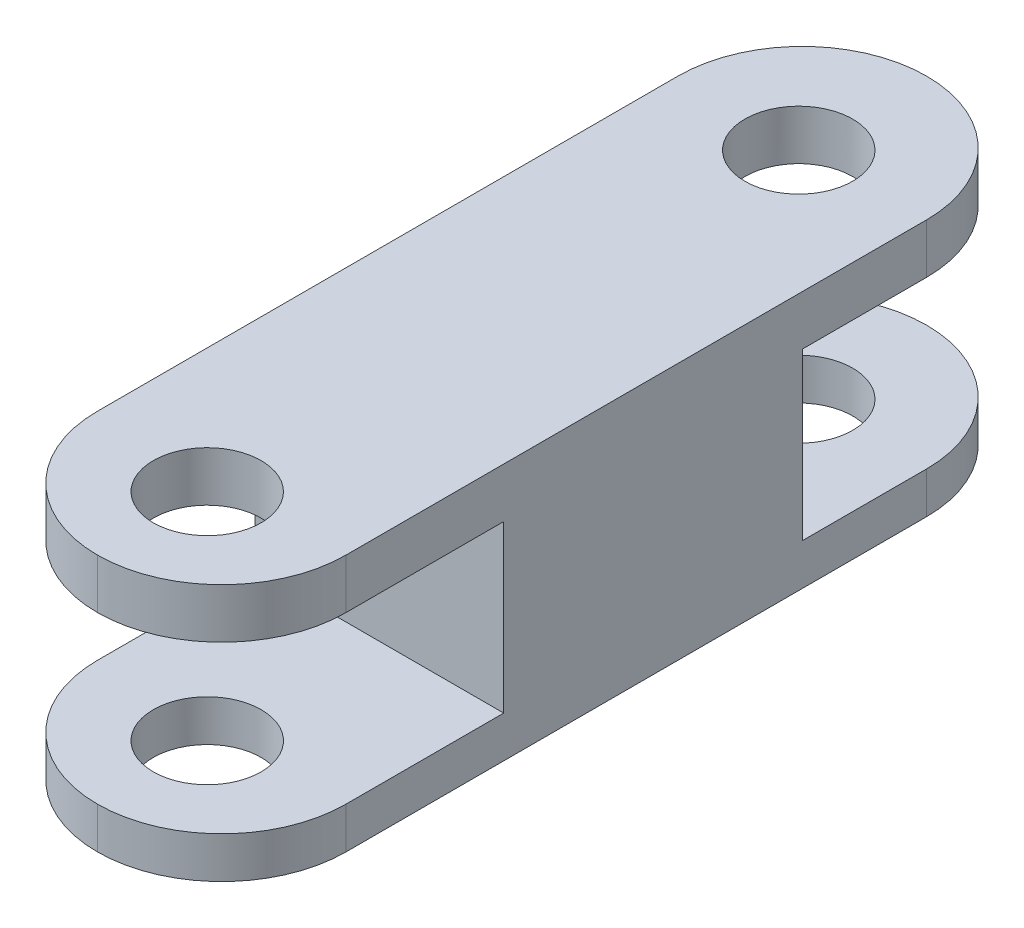
ISO-10303-21;
HEADER;
FILE_DESCRIPTION(('STEP AP214'),'2;1');
FILE_NAME('part.step','',(''),(''),'','','');
FILE_SCHEMA(('AUTOMOTIVE_DESIGN { 1 0 10303 214 1 1 1 1 }'));
ENDSEC;
DATA;
#1=APPLICATION_CONTEXT('core data for automotive mechanical design processes');
#2=APPLICATION_PROTOCOL_DEFINITION('international standard','automotive_design',2000,#1);
#3=PRODUCT_CONTEXT('',#1,'mechanical');
#4=PRODUCT('Part','Part','',(#3));
#5=PRODUCT_RELATED_PRODUCT_CATEGORY('part','',(#4));
#6=PRODUCT_DEFINITION_FORMATION('','',#4);
#7=PRODUCT_DEFINITION_CONTEXT('part definition',#1,'design');
#8=PRODUCT_DEFINITION('design','',#6,#7);
#9=PRODUCT_DEFINITION_SHAPE('','',#8);
#10=(LENGTH_UNIT() NAMED_UNIT(*) SI_UNIT(.MILLI.,.METRE.));
#11=(NAMED_UNIT(*) PLANE_ANGLE_UNIT() SI_UNIT($,.RADIAN.));
#12=(NAMED_UNIT(*) SI_UNIT($,.STERADIAN.) SOLID_ANGLE_UNIT());
#13=UNCERTAINTY_MEASURE_WITH_UNIT(LENGTH_MEASURE(1.E-05),#10,'distance_accuracy_value','');
#14=(GEOMETRIC_REPRESENTATION_CONTEXT(3) GLOBAL_UNCERTAINTY_ASSIGNED_CONTEXT((#13)) GLOBAL_UNIT_ASSIGNED_CONTEXT((#10,
#11,#12)) REPRESENTATION_CONTEXT('',''));
#15=CARTESIAN_POINT('',(0.,0.,0.));
#16=DIRECTION('',(0.,0.,1.));
#17=DIRECTION('',(1.,0.,0.));
#18=AXIS2_PLACEMENT_3D('',#15,#16,#17);
#19=CARTESIAN_POINT('',(-3.81,7.874,54.3941198587564));
#20=DIRECTION('',(0.,1.,0.));
#21=DIRECTION('',(0.,0.,1.));
#22=AXIS2_PLACEMENT_3D('',#19,#20,#21);
#23=CYLINDRICAL_SURFACE('',#22,3.81);
#24=CARTESIAN_POINT('',(-3.81,6.34827238378116,54.3941198587564));
#25=DIRECTION('',(0.,1.,0.));
#26=DIRECTION('',(0.,0.,1.));
#27=AXIS2_PLACEMENT_3D('',#24,#25,#26);
#28=CIRCLE('',#27,3.81);
#29=CARTESIAN_POINT('',(-3.81,6.34827238378116,58.2041198587564));
#30=VERTEX_POINT('',#29);
#31=CARTESIAN_POINT('',(-7.62,6.34827238378116,54.3941198587564));
#32=VERTEX_POINT('',#31);
#33=EDGE_CURVE('E245',#30,#32,#28,.F.);
#34=ORIENTED_EDGE('',*,*,#33,.F.);
#35=DIRECTION('',(0.,-1.,0.));
#36=VECTOR('',#35,1.);
#37=CARTESIAN_POINT('',(-3.81,0.,58.2041198587564));
#38=LINE('',#37,#36);
#39=CARTESIAN_POINT('',(-3.81,7.874,58.2041198587564));
#40=VERTEX_POINT('',#39);
#41=EDGE_CURVE('E188',#40,#30,#38,.T.);
#42=ORIENTED_EDGE('',*,*,#41,.F.);
#43=CARTESIAN_POINT('',(-3.81,7.874,54.3941198587564));
#44=DIRECTION('',(0.,-1.,0.));
#45=DIRECTION('',(0.,0.,-1.));
#46=AXIS2_PLACEMENT_3D('',#43,#44,#45);
#47=CIRCLE('',#46,3.81);
#48=CARTESIAN_POINT('',(-7.62,7.874,54.3941198587564));
#49=VERTEX_POINT('',#48);
#50=EDGE_CURVE('E264',#49,#40,#47,.F.);
#51=ORIENTED_EDGE('',*,*,#50,.F.);
#52=DIRECTION('',(0.,-1.,0.));
#53=VECTOR('',#52,1.);
#54=CARTESIAN_POINT('',(-7.62,7.874,54.3941198587564));
#55=LINE('',#54,#53);
#56=EDGE_CURVE('E248',#32,#49,#55,.F.);
#57=ORIENTED_EDGE('',*,*,#56,.F.);
#58=EDGE_LOOP('',(#34,#42,#51,#57));
#59=FACE_BOUND('',#58,.T.);
#60=ADVANCED_FACE('F45',(#59),#23,.T.);
#61=CARTESIAN_POINT('',(-3.81,1.26827238378116,58.2041198587564));
#62=VERTEX_POINT('',#61);
#63=CARTESIAN_POINT('',(-3.81,0.,58.2041198587564));
#64=VERTEX_POINT('',#63);
#65=EDGE_CURVE('E164',#62,#64,#38,.T.);
#66=ORIENTED_EDGE('',*,*,#65,.F.);
#67=CARTESIAN_POINT('',(-3.81,1.26827238378116,54.3941198587564));
#68=DIRECTION('',(0.,-1.,0.));
#69=DIRECTION('',(0.,0.,-1.));
#70=AXIS2_PLACEMENT_3D('',#67,#68,#69);
#71=CIRCLE('',#70,3.81);
#72=CARTESIAN_POINT('',(-7.62,1.26827238378116,54.3941198587564));
#73=VERTEX_POINT('',#72);
#74=EDGE_CURVE('E174',#73,#62,#71,.F.);
#75=ORIENTED_EDGE('',*,*,#74,.F.);
#76=CARTESIAN_POINT('',(-7.62,0.,54.3941198587564));
#77=VERTEX_POINT('',#76);
#78=EDGE_CURVE('E324',#77,#73,#55,.F.);
#79=ORIENTED_EDGE('',*,*,#78,.F.);
#80=CARTESIAN_POINT('',(-3.81,0.,54.3941198587564));
#81=DIRECTION('',(0.,-1.,0.));
#82=DIRECTION('',(0.,0.,-1.));
#83=AXIS2_PLACEMENT_3D('',#80,#81,#82);
#84=CIRCLE('',#83,3.81);
#85=EDGE_CURVE('E186',#64,#77,#84,.T.);
#86=ORIENTED_EDGE('',*,*,#85,.F.);
#87=EDGE_LOOP('',(#66,#75,#79,#86));
#88=FACE_BOUND('',#87,.T.);
#89=ADVANCED_FACE('F185',(#88),#23,.T.);
#90=CARTESIAN_POINT('',(-3.81,7.874,54.3941198587564));
#91=DIRECTION('',(0.,-1.,0.));
#92=DIRECTION('',(0.,0.,-1.));
#93=AXIS2_PLACEMENT_3D('',#90,#91,#92);
#94=CYLINDRICAL_SURFACE('',#93,3.81);
#95=ORIENTED_EDGE('',*,*,#41,.T.);
#96=CARTESIAN_POINT('',(-3.81,6.34827238378116,54.3941198587564));
#97=DIRECTION('',(0.,1.,0.));
#98=DIRECTION('',(0.,0.,1.));
#99=AXIS2_PLACEMENT_3D('',#96,#97,#98);
#100=CIRCLE('',#99,3.81);
#101=CARTESIAN_POINT('',(0.,6.34827238378116,54.3941198587564));
#102=VERTEX_POINT('',#101);
#103=EDGE_CURVE('E252',#102,#30,#100,.F.);
#104=ORIENTED_EDGE('',*,*,#103,.F.);
#105=DIRECTION('',(0.,-1.,0.));
#106=VECTOR('',#105,1.);
#107=CARTESIAN_POINT('',(0.,7.874,54.3941198587564));
#108=LINE('',#107,#106);
#109=CARTESIAN_POINT('',(0.,7.874,54.3941198587564));
#110=VERTEX_POINT('',#109);
#111=EDGE_CURVE('E261',#110,#102,#108,.T.);
#112=ORIENTED_EDGE('',*,*,#111,.F.);
#113=CARTESIAN_POINT('',(-3.81,7.874,54.3941198587564));
#114=DIRECTION('',(0.,-1.,0.));
#115=DIRECTION('',(0.,0.,-1.));
#116=AXIS2_PLACEMENT_3D('',#113,#114,#115);
#117=CIRCLE('',#116,3.81);
#118=EDGE_CURVE('E260',#40,#110,#117,.F.);
#119=ORIENTED_EDGE('',*,*,#118,.F.);
#120=EDGE_LOOP('',(#95,#104,#112,#119));
#121=FACE_BOUND('',#120,.T.);
#122=ADVANCED_FACE('F242',(#121),#94,.T.);
#123=CARTESIAN_POINT('',(-3.81,1.26827238378116,54.3941198587564));
#124=DIRECTION('',(0.,-1.,0.));
#125=DIRECTION('',(0.,0.,-1.));
#126=AXIS2_PLACEMENT_3D('',#123,#124,#125);
#127=CIRCLE('',#126,3.81);
#128=CARTESIAN_POINT('',(0.,1.26827238378116,54.3941198587564));
#129=VERTEX_POINT('',#128);
#130=EDGE_CURVE('E159',#62,#129,#127,.F.);
#131=ORIENTED_EDGE('',*,*,#130,.F.);
#132=ORIENTED_EDGE('',*,*,#65,.T.);
#133=CARTESIAN_POINT('',(-3.81,0.,54.3941198587564));
#134=DIRECTION('',(0.,-1.,0.));
#135=DIRECTION('',(0.,0.,-1.));
#136=AXIS2_PLACEMENT_3D('',#133,#134,#135);
#137=CIRCLE('',#136,3.81);
#138=CARTESIAN_POINT('',(0.,0.,54.3941198587564));
#139=VERTEX_POINT('',#138);
#140=EDGE_CURVE('E332',#139,#64,#137,.T.);
#141=ORIENTED_EDGE('',*,*,#140,.F.);
#142=EDGE_CURVE('E166',#129,#139,#108,.T.);
#143=ORIENTED_EDGE('',*,*,#142,.F.);
#144=EDGE_LOOP('',(#131,#132,#141,#143));
#145=FACE_BOUND('',#144,.T.);
#146=ADVANCED_FACE('F161',(#145),#94,.T.);
#147=CARTESIAN_POINT('',(-3.80558663679369,0.,54.8415805854161));
#148=DIRECTION('',(0.,1.,0.));
#149=DIRECTION('',(0.,0.,1.));
#150=AXIS2_PLACEMENT_3D('',#147,#148,#149);
#151=CYLINDRICAL_SURFACE('',#150,1.651);
#152=CARTESIAN_POINT('',(-3.80558663679369,7.874,54.8415805854161));
#153=DIRECTION('',(0.,1.,0.));
#154=DIRECTION('',(0.,0.,1.));
#155=AXIS2_PLACEMENT_3D('',#152,#153,#154);
#156=CIRCLE('',#155,1.651);
#157=CARTESIAN_POINT('',(-3.80558663679369,7.874,56.4925805854161));
#158=VERTEX_POINT('',#157);
#159=EDGE_CURVE('E196',#158,#158,#156,.T.);
#160=ORIENTED_EDGE('',*,*,#159,.T.);
#161=EDGE_LOOP('',(#160));
#162=FACE_BOUND('',#161,.T.);
#163=CARTESIAN_POINT('',(-3.80558663679369,6.34827238378116,54.8415805854161));
#164=DIRECTION('',(0.,1.,0.));
#165=DIRECTION('',(0.,0.,1.));
#166=AXIS2_PLACEMENT_3D('',#163,#164,#165);
#167=CIRCLE('',#166,1.651);
#168=CARTESIAN_POINT('',(-3.80558663679369,6.34827238378116,56.4925805854161));
#169=VERTEX_POINT('',#168);
#170=EDGE_CURVE('E214',#169,#169,#167,.F.);
#171=ORIENTED_EDGE('',*,*,#170,.T.);
#172=EDGE_LOOP('',(#171));
#173=FACE_BOUND('',#172,.T.);
#174=ADVANCED_FACE('F392',(#162,#173),#151,.F.);
#175=CARTESIAN_POINT('',(-3.80558663679369,0.,54.8415805854161));
#176=DIRECTION('',(0.,1.,0.));
#177=DIRECTION('',(0.,0.,1.));
#178=AXIS2_PLACEMENT_3D('',#175,#176,#177);
#179=CIRCLE('',#178,1.651);
#180=CARTESIAN_POINT('',(-3.80558663679369,0.,56.4925805854161));
#181=VERTEX_POINT('',#180);
#182=EDGE_CURVE('E189',#181,#181,#179,.T.);
#183=ORIENTED_EDGE('',*,*,#182,.F.);
#184=EDGE_LOOP('',(#183));
#185=FACE_BOUND('',#184,.T.);
#186=CARTESIAN_POINT('',(-3.80558663679369,1.26827238378116,54.8415805854161));
#187=DIRECTION('',(0.,-1.,0.));
#188=DIRECTION('',(0.,0.,-1.));
#189=AXIS2_PLACEMENT_3D('',#186,#187,#188);
#190=CIRCLE('',#189,1.651);
#191=CARTESIAN_POINT('',(-3.80558663679369,1.26827238378116,53.1905805854161));
#192=VERTEX_POINT('',#191);
#193=EDGE_CURVE('E53',#192,#192,#190,.F.);
#194=ORIENTED_EDGE('',*,*,#193,.T.);
#195=EDGE_LOOP('',(#194));
#196=FACE_BOUND('',#195,.T.);
#197=ADVANCED_FACE('F221',(#185,#196),#151,.F.);
#198=CARTESIAN_POINT('',(-3.80558663679368,0.,36.7263005854161));
#199=DIRECTION('',(0.,1.,0.));
#200=DIRECTION('',(0.,0.,1.));
#201=AXIS2_PLACEMENT_3D('',#198,#199,#200);
#202=CYLINDRICAL_SURFACE('',#201,1.651);
#203=CARTESIAN_POINT('',(-3.80558663679368,0.,36.7263005854161));
#204=DIRECTION('',(0.,1.,0.));
#205=DIRECTION('',(0.,0.,1.));
#206=AXIS2_PLACEMENT_3D('',#203,#204,#205);
#207=CIRCLE('',#206,1.651);
#208=CARTESIAN_POINT('',(-3.80558663679368,0.,38.3773005854161));
#209=VERTEX_POINT('',#208);
#210=EDGE_CURVE('E374',#209,#209,#207,.T.);
#211=ORIENTED_EDGE('',*,*,#210,.F.);
#212=EDGE_LOOP('',(#211));
#213=FACE_BOUND('',#212,.T.);
#214=CARTESIAN_POINT('',(-3.80558663679368,1.26827238378116,36.7263005854161));
#215=DIRECTION('',(0.,1.,0.));
#216=DIRECTION('',(0.,0.,1.));
#217=AXIS2_PLACEMENT_3D('',#214,#215,#216);
#218=CIRCLE('',#217,1.651);
#219=CARTESIAN_POINT('',(-3.80558663679368,1.26827238378116,38.3773005854161));
#220=VERTEX_POINT('',#219);
#221=EDGE_CURVE('E202',#220,#220,#218,.F.);
#222=ORIENTED_EDGE('',*,*,#221,.F.);
#223=EDGE_LOOP('',(#222));
#224=FACE_BOUND('',#223,.T.);
#225=ADVANCED_FACE('F400',(#213,#224),#202,.F.);
#226=CARTESIAN_POINT('',(-3.80999999999999,7.874,36.6141198587564));
#227=DIRECTION('',(0.,-1.,0.));
#228=DIRECTION('',(0.,0.,-1.));
#229=AXIS2_PLACEMENT_3D('',#226,#227,#228);
#230=CYLINDRICAL_SURFACE('',#229,3.81);
#231=CARTESIAN_POINT('',(-3.80999999999999,1.26827238378116,36.6141198587564));
#232=DIRECTION('',(0.,-1.,0.));
#233=DIRECTION('',(0.,0.,-1.));
#234=AXIS2_PLACEMENT_3D('',#231,#232,#233);
#235=CIRCLE('',#234,3.81);
#236=CARTESIAN_POINT('',(0.,1.26827238378116,36.6141198587564));
#237=VERTEX_POINT('',#236);
#238=CARTESIAN_POINT('',(-3.80999999999999,1.26827238378116,32.8041198587565));
#239=VERTEX_POINT('',#238);
#240=EDGE_CURVE('E349',#237,#239,#235,.F.);
#241=ORIENTED_EDGE('',*,*,#240,.F.);
#242=DIRECTION('',(0.,-1.,0.));
#243=VECTOR('',#242,1.);
#244=CARTESIAN_POINT('',(0.,7.874,36.6141198587564));
#245=LINE('',#244,#243);
#246=CARTESIAN_POINT('',(0.,0.,36.6141198587564));
#247=VERTEX_POINT('',#246);
#248=EDGE_CURVE('E207',#247,#237,#245,.F.);
#249=ORIENTED_EDGE('',*,*,#248,.F.);
#250=CARTESIAN_POINT('',(-3.80999999999999,0.,36.6141198587564));
#251=DIRECTION('',(0.,-1.,0.));
#252=DIRECTION('',(0.,0.,-1.));
#253=AXIS2_PLACEMENT_3D('',#250,#251,#252);
#254=CIRCLE('',#253,3.81);
#255=CARTESIAN_POINT('',(-3.80999999999999,0.,32.8041198587565));
#256=VERTEX_POINT('',#255);
#257=EDGE_CURVE('E335',#256,#247,#254,.T.);
#258=ORIENTED_EDGE('',*,*,#257,.F.);
#259=DIRECTION('',(0.,-1.,0.));
#260=VECTOR('',#259,1.);
#261=CARTESIAN_POINT('',(-3.80999999999999,7.874,32.8041198587565));
#262=LINE('',#261,#260);
#263=EDGE_CURVE('E194',#239,#256,#262,.T.);
#264=ORIENTED_EDGE('',*,*,#263,.F.);
#265=EDGE_LOOP('',(#241,#249,#258,#264));
#266=FACE_BOUND('',#265,.T.);
#267=ADVANCED_FACE('F348',(#266),#230,.T.);
#268=CARTESIAN_POINT('',(-3.80999999999999,7.874,36.6141198587564));
#269=DIRECTION('',(0.,1.,0.));
#270=DIRECTION('',(0.,0.,1.));
#271=AXIS2_PLACEMENT_3D('',#268,#269,#270);
#272=CYLINDRICAL_SURFACE('',#271,3.81);
#273=CARTESIAN_POINT('',(-3.80999999999999,1.26827238378116,36.6141198587564));
#274=DIRECTION('',(0.,-1.,0.));
#275=DIRECTION('',(0.,0.,-1.));
#276=AXIS2_PLACEMENT_3D('',#273,#274,#275);
#277=CIRCLE('',#276,3.81);
#278=CARTESIAN_POINT('',(-7.62,1.26827238378116,36.6141198587564));
#279=VERTEX_POINT('',#278);
#280=EDGE_CURVE('E355',#239,#279,#277,.F.);
#281=ORIENTED_EDGE('',*,*,#280,.F.);
#282=ORIENTED_EDGE('',*,*,#263,.T.);
#283=CARTESIAN_POINT('',(-3.80999999999999,0.,36.6141198587564));
#284=DIRECTION('',(0.,-1.,0.));
#285=DIRECTION('',(0.,0.,-1.));
#286=AXIS2_PLACEMENT_3D('',#283,#284,#285);
#287=CIRCLE('',#286,3.81);
#288=CARTESIAN_POINT('',(-7.61999999999999,0.,36.6141198587564));
#289=VERTEX_POINT('',#288);
#290=EDGE_CURVE('E270',#289,#256,#287,.T.);
#291=ORIENTED_EDGE('',*,*,#290,.F.);
#292=DIRECTION('',(0.,-1.,0.));
#293=VECTOR('',#292,1.);
#294=CARTESIAN_POINT('',(-7.61999999999999,0.,36.6141198587564));
#295=LINE('',#294,#293);
#296=EDGE_CURVE('E327',#279,#289,#295,.T.);
#297=ORIENTED_EDGE('',*,*,#296,.F.);
#298=EDGE_LOOP('',(#281,#282,#291,#297));
#299=FACE_BOUND('',#298,.T.);
#300=ADVANCED_FACE('F412',(#299),#272,.T.);
#301=CARTESIAN_POINT('',(-7.61999999999999,7.874,32.8041198587565));
#302=DIRECTION('',(1.,0.,0.));
#303=DIRECTION('',(0.,0.,-1.));
#304=AXIS2_PLACEMENT_3D('',#301,#302,#303);
#305=PLANE('',#304);
#306=ORIENTED_EDGE('',*,*,#78,.T.);
#307=DIRECTION('',(0.,0.,-1.));
#308=VECTOR('',#307,1.);
#309=CARTESIAN_POINT('',(-7.61999999999999,1.26827238378116,32.8041198587565));
#310=LINE('',#309,#308);
#311=CARTESIAN_POINT('',(-7.61999999999999,1.26827238378116,49.5681198587564));
#312=VERTEX_POINT('',#311);
#313=EDGE_CURVE('E178',#73,#312,#310,.T.);
#314=ORIENTED_EDGE('',*,*,#313,.T.);
#315=DIRECTION('',(0.,1.,0.));
#316=VECTOR('',#315,1.);
#317=CARTESIAN_POINT('',(-7.61999999999999,7.874,49.5681198587564));
#318=LINE('',#317,#316);
#319=CARTESIAN_POINT('',(-7.61999999999999,6.34827238378116,49.5681198587564));
#320=VERTEX_POINT('',#319);
#321=EDGE_CURVE('E561',#312,#320,#318,.T.);
#322=ORIENTED_EDGE('',*,*,#321,.T.);
#323=DIRECTION('',(0.,0.,1.));
#324=VECTOR('',#323,1.);
#325=CARTESIAN_POINT('',(-7.61999999999999,6.34827238378116,32.8041198587565));
#326=LINE('',#325,#324);
#327=EDGE_CURVE('E171',#320,#32,#326,.T.);
#328=ORIENTED_EDGE('',*,*,#327,.T.);
#329=ORIENTED_EDGE('',*,*,#56,.T.);
#330=DIRECTION('',(0.,0.,1.));
#331=VECTOR('',#330,1.);
#332=CARTESIAN_POINT('',(-7.61999999999999,7.874,32.8041198587565));
#333=LINE('',#332,#331);
#334=CARTESIAN_POINT('',(-7.61999999999999,7.874,36.6141198587564));
#335=VERTEX_POINT('',#334);
#336=EDGE_CURVE('E295',#335,#49,#333,.T.);
#337=ORIENTED_EDGE('',*,*,#336,.F.);
#338=CARTESIAN_POINT('',(-7.62,6.34827238378116,36.6141198587564));
#339=VERTEX_POINT('',#338);
#340=EDGE_CURVE('E307',#335,#339,#295,.T.);
#341=ORIENTED_EDGE('',*,*,#340,.T.);
#342=DIRECTION('',(0.,0.,-1.));
#343=VECTOR('',#342,1.);
#344=CARTESIAN_POINT('',(-7.62,6.34827238378116,40.4241198587564));
#345=LINE('',#344,#343);
#346=CARTESIAN_POINT('',(-7.62,6.34827238378116,40.4241198587564));
#347=VERTEX_POINT('',#346);
#348=EDGE_CURVE('E571',#347,#339,#345,.T.);
#349=ORIENTED_EDGE('',*,*,#348,.F.);
#350=DIRECTION('',(0.,1.,0.));
#351=VECTOR('',#350,1.);
#352=CARTESIAN_POINT('',(-7.62,6.34827238378116,40.4241198587564));
#353=LINE('',#352,#351);
#354=CARTESIAN_POINT('',(-7.62,1.26827238378116,40.4241198587564));
#355=VERTEX_POINT('',#354);
#356=EDGE_CURVE('E354',#347,#355,#353,.F.);
#357=ORIENTED_EDGE('',*,*,#356,.T.);
#358=DIRECTION('',(0.,0.,1.));
#359=VECTOR('',#358,1.);
#360=CARTESIAN_POINT('',(-7.62,1.26827238378116,36.6141198587564));
#361=LINE('',#360,#359);
#362=EDGE_CURVE('E568',#279,#355,#361,.T.);
#363=ORIENTED_EDGE('',*,*,#362,.F.);
#364=ORIENTED_EDGE('',*,*,#296,.T.);
#365=DIRECTION('',(0.,0.,1.));
#366=VECTOR('',#365,1.);
#367=CARTESIAN_POINT('',(-7.61999999999999,0.,32.8041198587565));
#368=LINE('',#367,#366);
#369=EDGE_CURVE('E303',#289,#77,#368,.T.);
#370=ORIENTED_EDGE('',*,*,#369,.T.);
#371=EDGE_LOOP('',(#306,#314,#322,#328,#329,#337,#341,#349,#357,#363,#364,#370));
#372=FACE_BOUND('',#371,.T.);
#373=ADVANCED_FACE('F311',(#372),#305,.F.);
#374=CARTESIAN_POINT('',(0.,7.874,32.8041198587565));
#375=DIRECTION('',(1.,0.,0.));
#376=DIRECTION('',(0.,0.,-1.));
#377=AXIS2_PLACEMENT_3D('',#374,#375,#376);
#378=PLANE('',#377);
#379=DIRECTION('',(0.,0.,-1.));
#380=VECTOR('',#379,1.);
#381=CARTESIAN_POINT('',(0.,1.26827238378116,32.8041198587565));
#382=LINE('',#381,#380);
#383=CARTESIAN_POINT('',(0.,1.26827238378116,49.5681198587564));
#384=VERTEX_POINT('',#383);
#385=EDGE_CURVE('E170',#129,#384,#382,.T.);
#386=ORIENTED_EDGE('',*,*,#385,.F.);
#387=ORIENTED_EDGE('',*,*,#142,.T.);
#388=DIRECTION('',(0.,0.,1.));
#389=VECTOR('',#388,1.);
#390=CARTESIAN_POINT('',(0.,0.,32.8041198587565));
#391=LINE('',#390,#389);
#392=EDGE_CURVE('E314',#247,#139,#391,.T.);
#393=ORIENTED_EDGE('',*,*,#392,.F.);
#394=ORIENTED_EDGE('',*,*,#248,.T.);
#395=DIRECTION('',(0.,0.,1.));
#396=VECTOR('',#395,1.);
#397=CARTESIAN_POINT('',(0.,1.26827238378116,32.8041198587565));
#398=LINE('',#397,#396);
#399=CARTESIAN_POINT('',(0.,1.26827238378116,40.4241198587564));
#400=VERTEX_POINT('',#399);
#401=EDGE_CURVE('E358',#237,#400,#398,.T.);
#402=ORIENTED_EDGE('',*,*,#401,.T.);
#403=DIRECTION('',(0.,-1.,0.));
#404=VECTOR('',#403,1.);
#405=CARTESIAN_POINT('',(0.,7.874,40.4241198587564));
#406=LINE('',#405,#404);
#407=CARTESIAN_POINT('',(0.,6.34827238378116,40.4241198587564));
#408=VERTEX_POINT('',#407);
#409=EDGE_CURVE('E211',#408,#400,#406,.T.);
#410=ORIENTED_EDGE('',*,*,#409,.F.);
#411=DIRECTION('',(0.,0.,-1.));
#412=VECTOR('',#411,1.);
#413=CARTESIAN_POINT('',(0.,6.34827238378116,32.8041198587565));
#414=LINE('',#413,#412);
#415=CARTESIAN_POINT('',(0.,6.34827238378116,36.6141198587564));
#416=VERTEX_POINT('',#415);
#417=EDGE_CURVE('E290',#408,#416,#414,.T.);
#418=ORIENTED_EDGE('',*,*,#417,.T.);
#419=CARTESIAN_POINT('',(0.,7.874,36.6141198587564));
#420=VERTEX_POINT('',#419);
#421=EDGE_CURVE('E277',#416,#420,#245,.F.);
#422=ORIENTED_EDGE('',*,*,#421,.T.);
#423=DIRECTION('',(0.,0.,1.));
#424=VECTOR('',#423,1.);
#425=CARTESIAN_POINT('',(0.,7.874,32.8041198587565));
#426=LINE('',#425,#424);
#427=EDGE_CURVE('E288',#420,#110,#426,.T.);
#428=ORIENTED_EDGE('',*,*,#427,.T.);
#429=ORIENTED_EDGE('',*,*,#111,.T.);
#430=DIRECTION('',(0.,0.,1.));
#431=VECTOR('',#430,1.);
#432=CARTESIAN_POINT('',(0.,6.34827238378116,32.8041198587565));
#433=LINE('',#432,#431);
#434=CARTESIAN_POINT('',(0.,6.34827238378116,49.5681198587564));
#435=VERTEX_POINT('',#434);
#436=EDGE_CURVE('E60',#435,#102,#433,.T.);
#437=ORIENTED_EDGE('',*,*,#436,.F.);
#438=DIRECTION('',(0.,1.,0.));
#439=VECTOR('',#438,1.);
#440=CARTESIAN_POINT('',(0.,7.874,49.5681198587564));
#441=LINE('',#440,#439);
#442=EDGE_CURVE('E11',#384,#435,#441,.T.);
#443=ORIENTED_EDGE('',*,*,#442,.F.);
#444=EDGE_LOOP('',(#386,#387,#393,#394,#402,#410,#418,#422,#428,#429,#437,#443));
#445=FACE_BOUND('',#444,.T.);
#446=ADVANCED_FACE('F287',(#445),#378,.T.);
#447=CARTESIAN_POINT('',(-3.80558663679368,7.874,36.7263005854161));
#448=DIRECTION('',(0.,1.,0.));
#449=DIRECTION('',(0.,0.,1.));
#450=AXIS2_PLACEMENT_3D('',#447,#448,#449);
#451=CIRCLE('',#450,1.651);
#452=CARTESIAN_POINT('',(-3.80558663679368,7.874,38.3773005854161));
#453=VERTEX_POINT('',#452);
#454=EDGE_CURVE('E368',#453,#453,#451,.T.);
#455=ORIENTED_EDGE('',*,*,#454,.T.);
#456=EDGE_LOOP('',(#455));
#457=FACE_BOUND('',#456,.T.);
#458=CARTESIAN_POINT('',(-3.80558663679368,6.34827238378116,36.7263005854161));
#459=DIRECTION('',(0.,-1.,0.));
#460=DIRECTION('',(0.,0.,-1.));
#461=AXIS2_PLACEMENT_3D('',#458,#459,#460);
#462=CIRCLE('',#461,1.651);
#463=CARTESIAN_POINT('',(-3.80558663679368,6.34827238378116,35.0753005854161));
#464=VERTEX_POINT('',#463);
#465=EDGE_CURVE('E206',#464,#464,#462,.F.);
#466=ORIENTED_EDGE('',*,*,#465,.F.);
#467=EDGE_LOOP('',(#466));
#468=FACE_BOUND('',#467,.T.);
#469=ADVANCED_FACE('F382',(#457,#468),#202,.F.);
#470=CARTESIAN_POINT('',(0.,7.874,0.));
#471=DIRECTION('',(0.,-1.,0.));
#472=DIRECTION('',(-1.,0.,0.));
#473=AXIS2_PLACEMENT_3D('',#470,#471,#472);
#474=PLANE('',#473);
#475=ORIENTED_EDGE('',*,*,#454,.F.);
#476=EDGE_LOOP('',(#475));
#477=FACE_BOUND('',#476,.T.);
#478=ORIENTED_EDGE('',*,*,#159,.F.);
#479=EDGE_LOOP('',(#478));
#480=FACE_BOUND('',#479,.T.);
#481=CARTESIAN_POINT('',(-3.80999999999999,7.874,36.6141198587564));
#482=DIRECTION('',(0.,-1.,0.));
#483=DIRECTION('',(0.,0.,-1.));
#484=AXIS2_PLACEMENT_3D('',#481,#482,#483);
#485=CIRCLE('',#484,3.81);
#486=CARTESIAN_POINT('',(-3.80999999999999,7.874,32.8041198587565));
#487=VERTEX_POINT('',#486);
#488=EDGE_CURVE('E68',#420,#487,#485,.F.);
#489=ORIENTED_EDGE('',*,*,#488,.T.);
#490=CARTESIAN_POINT('',(-3.80999999999999,7.874,36.6141198587564));
#491=DIRECTION('',(0.,-1.,0.));
#492=DIRECTION('',(0.,0.,-1.));
#493=AXIS2_PLACEMENT_3D('',#490,#491,#492);
#494=CIRCLE('',#493,3.81);
#495=EDGE_CURVE('E268',#487,#335,#494,.F.);
#496=ORIENTED_EDGE('',*,*,#495,.T.);
#497=ORIENTED_EDGE('',*,*,#336,.T.);
#498=ORIENTED_EDGE('',*,*,#50,.T.);
#499=ORIENTED_EDGE('',*,*,#118,.T.);
#500=ORIENTED_EDGE('',*,*,#427,.F.);
#501=EDGE_LOOP('',(#489,#496,#497,#498,#499,#500));
#502=FACE_BOUND('',#501,.T.);
#503=ADVANCED_FACE('F293',(#477,#480,#502),#474,.F.);
#504=CARTESIAN_POINT('',(0.,0.,0.));
#505=DIRECTION('',(0.,-1.,0.));
#506=DIRECTION('',(-1.,0.,0.));
#507=AXIS2_PLACEMENT_3D('',#504,#505,#506);
#508=PLANE('',#507);
#509=ORIENTED_EDGE('',*,*,#210,.T.);
#510=EDGE_LOOP('',(#509));
#511=FACE_BOUND('',#510,.T.);
#512=ORIENTED_EDGE('',*,*,#182,.T.);
#513=EDGE_LOOP('',(#512));
#514=FACE_BOUND('',#513,.T.);
#515=ORIENTED_EDGE('',*,*,#369,.F.);
#516=ORIENTED_EDGE('',*,*,#290,.T.);
#517=ORIENTED_EDGE('',*,*,#257,.T.);
#518=ORIENTED_EDGE('',*,*,#392,.T.);
#519=ORIENTED_EDGE('',*,*,#140,.T.);
#520=ORIENTED_EDGE('',*,*,#85,.T.);
#521=EDGE_LOOP('',(#515,#516,#517,#518,#519,#520));
#522=FACE_BOUND('',#521,.T.);
#523=ADVANCED_FACE('F343',(#511,#514,#522),#508,.T.);
#524=CARTESIAN_POINT('',(-3.80999999999999,6.34827238378116,36.6141198587564));
#525=DIRECTION('',(0.,1.,0.));
#526=DIRECTION('',(0.,0.,1.));
#527=AXIS2_PLACEMENT_3D('',#524,#525,#526);
#528=CIRCLE('',#527,3.81);
#529=CARTESIAN_POINT('',(-3.80999999999999,6.34827238378116,32.8041198587565));
#530=VERTEX_POINT('',#529);
#531=EDGE_CURVE('E300',#530,#416,#528,.F.);
#532=ORIENTED_EDGE('',*,*,#531,.F.);
#533=EDGE_CURVE('E200',#487,#530,#262,.T.);
#534=ORIENTED_EDGE('',*,*,#533,.F.);
#535=ORIENTED_EDGE('',*,*,#488,.F.);
#536=ORIENTED_EDGE('',*,*,#421,.F.);
#537=EDGE_LOOP('',(#532,#534,#535,#536));
#538=FACE_BOUND('',#537,.T.);
#539=ADVANCED_FACE('F297',(#538),#230,.T.);
#540=CARTESIAN_POINT('',(-3.80999999999999,6.34827238378116,36.6141198587564));
#541=DIRECTION('',(0.,1.,0.));
#542=DIRECTION('',(0.,0.,1.));
#543=AXIS2_PLACEMENT_3D('',#540,#541,#542);
#544=CIRCLE('',#543,3.81);
#545=EDGE_CURVE('E555',#339,#530,#544,.F.);
#546=ORIENTED_EDGE('',*,*,#545,.F.);
#547=ORIENTED_EDGE('',*,*,#340,.F.);
#548=ORIENTED_EDGE('',*,*,#495,.F.);
#549=ORIENTED_EDGE('',*,*,#533,.T.);
#550=EDGE_LOOP('',(#546,#547,#548,#549));
#551=FACE_BOUND('',#550,.T.);
#552=ADVANCED_FACE('F305',(#551),#272,.T.);
#553=CARTESIAN_POINT('',(-7.62,6.34827238378116,40.4241198587564));
#554=DIRECTION('',(0.,-1.,0.));
#555=DIRECTION('',(0.,0.,-1.));
#556=AXIS2_PLACEMENT_3D('',#553,#554,#555);
#557=PLANE('',#556);
#558=ORIENTED_EDGE('',*,*,#531,.T.);
#559=ORIENTED_EDGE('',*,*,#417,.F.);
#560=DIRECTION('',(1.,0.,0.));
#561=VECTOR('',#560,1.);
#562=CARTESIAN_POINT('',(-7.62,6.34827238378116,40.4241198587564));
#563=LINE('',#562,#561);
#564=EDGE_CURVE('E364',#347,#408,#563,.T.);
#565=ORIENTED_EDGE('',*,*,#564,.F.);
#566=ORIENTED_EDGE('',*,*,#348,.T.);
#567=ORIENTED_EDGE('',*,*,#545,.T.);
#568=EDGE_LOOP('',(#558,#559,#565,#566,#567));
#569=FACE_BOUND('',#568,.T.);
#570=ORIENTED_EDGE('',*,*,#465,.T.);
#571=EDGE_LOOP('',(#570));
#572=FACE_BOUND('',#571,.T.);
#573=ADVANCED_FACE('F415',(#569,#572),#557,.T.);
#574=CARTESIAN_POINT('',(-7.62,1.26827238378116,36.6141198587564));
#575=DIRECTION('',(0.,1.,0.));
#576=DIRECTION('',(0.,0.,1.));
#577=AXIS2_PLACEMENT_3D('',#574,#575,#576);
#578=PLANE('',#577);
#579=ORIENTED_EDGE('',*,*,#401,.F.);
#580=ORIENTED_EDGE('',*,*,#240,.T.);
#581=ORIENTED_EDGE('',*,*,#280,.T.);
#582=ORIENTED_EDGE('',*,*,#362,.T.);
#583=DIRECTION('',(1.,0.,0.));
#584=VECTOR('',#583,1.);
#585=CARTESIAN_POINT('',(-7.62,1.26827238378116,40.4241198587564));
#586=LINE('',#585,#584);
#587=EDGE_CURVE('E362',#355,#400,#586,.T.);
#588=ORIENTED_EDGE('',*,*,#587,.T.);
#589=EDGE_LOOP('',(#579,#580,#581,#582,#588));
#590=FACE_BOUND('',#589,.T.);
#591=ORIENTED_EDGE('',*,*,#221,.T.);
#592=EDGE_LOOP('',(#591));
#593=FACE_BOUND('',#592,.T.);
#594=ADVANCED_FACE('F359',(#590,#593),#578,.T.);
#595=CARTESIAN_POINT('',(-7.62,6.34827238378116,40.4241198587564));
#596=DIRECTION('',(0.,0.,1.));
#597=DIRECTION('',(1.,0.,0.));
#598=AXIS2_PLACEMENT_3D('',#595,#596,#597);
#599=PLANE('',#598);
#600=ORIENTED_EDGE('',*,*,#409,.T.);
#601=ORIENTED_EDGE('',*,*,#587,.F.);
#602=ORIENTED_EDGE('',*,*,#356,.F.);
#603=ORIENTED_EDGE('',*,*,#564,.T.);
#604=EDGE_LOOP('',(#600,#601,#602,#603));
#605=FACE_BOUND('',#604,.T.);
#606=ADVANCED_FACE('F233',(#605),#599,.F.);
#607=CARTESIAN_POINT('',(1.19999999821559E-05,6.34827238378116,49.5681198587564));
#608=DIRECTION('',(0.,0.,-1.));
#609=DIRECTION('',(-1.,0.,0.));
#610=AXIS2_PLACEMENT_3D('',#607,#608,#609);
#611=PLANE('',#610);
#612=DIRECTION('',(-1.,0.,0.));
#613=VECTOR('',#612,1.);
#614=CARTESIAN_POINT('',(1.19999999821559E-05,1.26827238378116,49.5681198587564));
#615=LINE('',#614,#613);
#616=EDGE_CURVE('E258',#384,#312,#615,.T.);
#617=ORIENTED_EDGE('',*,*,#616,.F.);
#618=ORIENTED_EDGE('',*,*,#442,.T.);
#619=DIRECTION('',(-1.,0.,0.));
#620=VECTOR('',#619,1.);
#621=CARTESIAN_POINT('',(1.19999999821559E-05,6.34827238378116,49.5681198587564));
#622=LINE('',#621,#620);
#623=EDGE_CURVE('E592',#435,#320,#622,.T.);
#624=ORIENTED_EDGE('',*,*,#623,.T.);
#625=ORIENTED_EDGE('',*,*,#321,.F.);
#626=EDGE_LOOP('',(#617,#618,#624,#625));
#627=FACE_BOUND('',#626,.T.);
#628=ADVANCED_FACE('F225',(#627),#611,.F.);
#629=CARTESIAN_POINT('',(1.19999999821559E-05,1.26827238378116,49.5681198587564));
#630=DIRECTION('',(0.,-1.,0.));
#631=DIRECTION('',(0.,0.,-1.));
#632=AXIS2_PLACEMENT_3D('',#629,#630,#631);
#633=PLANE('',#632);
#634=ORIENTED_EDGE('',*,*,#193,.F.);
#635=EDGE_LOOP('',(#634));
#636=FACE_BOUND('',#635,.T.);
#637=ORIENTED_EDGE('',*,*,#74,.T.);
#638=ORIENTED_EDGE('',*,*,#130,.T.);
#639=ORIENTED_EDGE('',*,*,#385,.T.);
#640=ORIENTED_EDGE('',*,*,#616,.T.);
#641=ORIENTED_EDGE('',*,*,#313,.F.);
#642=EDGE_LOOP('',(#637,#638,#639,#640,#641));
#643=FACE_BOUND('',#642,.T.);
#644=ADVANCED_FACE('F175',(#636,#643),#633,.F.);
#645=CARTESIAN_POINT('',(1.19999999802733E-05,6.34827238378116,54.6481198587565));
#646=DIRECTION('',(0.,1.,0.));
#647=DIRECTION('',(0.,0.,1.));
#648=AXIS2_PLACEMENT_3D('',#645,#646,#647);
#649=PLANE('',#648);
#650=ORIENTED_EDGE('',*,*,#103,.T.);
#651=ORIENTED_EDGE('',*,*,#33,.T.);
#652=ORIENTED_EDGE('',*,*,#327,.F.);
#653=ORIENTED_EDGE('',*,*,#623,.F.);
#654=ORIENTED_EDGE('',*,*,#436,.T.);
#655=EDGE_LOOP('',(#650,#651,#652,#653,#654));
#656=FACE_BOUND('',#655,.T.);
#657=ORIENTED_EDGE('',*,*,#170,.F.);
#658=EDGE_LOOP('',(#657));
#659=FACE_BOUND('',#658,.T.);
#660=ADVANCED_FACE('F224',(#656,#659),#649,.F.);
#661=CLOSED_SHELL('',(#60,#89,#122,#146,#174,#197,#225,#267,#300,#373,#446,#469,#503,#523,#539,
#552,#573,#594,#606,#628,#644,#660));
#662=MANIFOLD_SOLID_BREP('B2',#661);
#663=ADVANCED_BREP_SHAPE_REPRESENTATION('',(#18,#662),#14);
#664=SHAPE_DEFINITION_REPRESENTATION(#9,#663);
ENDSEC;
END-ISO-10303-21;
